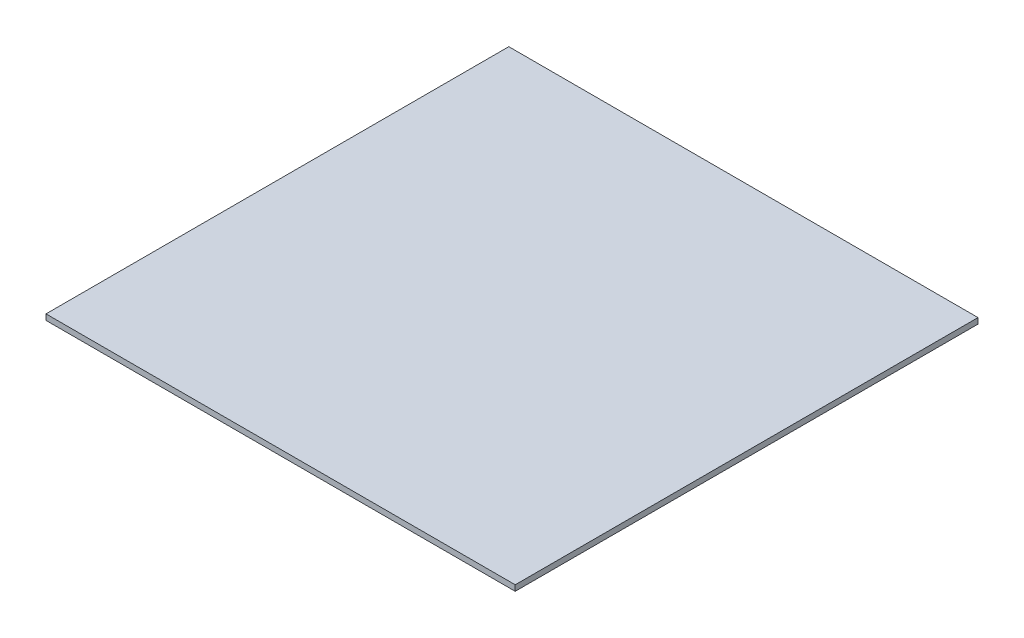
ISO-10303-21;
HEADER;
FILE_DESCRIPTION(('STEP AP214'),'2;1');
FILE_NAME('part.step','',(''),(''),'','','');
FILE_SCHEMA(('AUTOMOTIVE_DESIGN { 1 0 10303 214 1 1 1 1 }'));
ENDSEC;
DATA;
#1=APPLICATION_CONTEXT('core data for automotive mechanical design processes');
#2=APPLICATION_PROTOCOL_DEFINITION('international standard','automotive_design',2000,#1);
#3=PRODUCT_CONTEXT('',#1,'mechanical');
#4=PRODUCT('Part','Part','',(#3));
#5=PRODUCT_RELATED_PRODUCT_CATEGORY('part','',(#4));
#6=PRODUCT_DEFINITION_FORMATION('','',#4);
#7=PRODUCT_DEFINITION_CONTEXT('part definition',#1,'design');
#8=PRODUCT_DEFINITION('design','',#6,#7);
#9=PRODUCT_DEFINITION_SHAPE('','',#8);
#10=(LENGTH_UNIT() NAMED_UNIT(*) SI_UNIT(.MILLI.,.METRE.));
#11=(NAMED_UNIT(*) PLANE_ANGLE_UNIT() SI_UNIT($,.RADIAN.));
#12=(NAMED_UNIT(*) SI_UNIT($,.STERADIAN.) SOLID_ANGLE_UNIT());
#13=UNCERTAINTY_MEASURE_WITH_UNIT(LENGTH_MEASURE(1.E-05),#10,'distance_accuracy_value','');
#14=(GEOMETRIC_REPRESENTATION_CONTEXT(3) GLOBAL_UNCERTAINTY_ASSIGNED_CONTEXT((#13)) GLOBAL_UNIT_ASSIGNED_CONTEXT((#10,
#11,#12)) REPRESENTATION_CONTEXT('',''));
#15=CARTESIAN_POINT('',(0.,0.,0.));
#16=DIRECTION('',(0.,0.,1.));
#17=DIRECTION('',(1.,0.,0.));
#18=AXIS2_PLACEMENT_3D('',#15,#16,#17);
#19=CARTESIAN_POINT('',(492.125,11.938,485.394));
#20=DIRECTION('',(-1.,0.,0.));
#21=DIRECTION('',(0.,0.,1.));
#22=AXIS2_PLACEMENT_3D('',#19,#20,#21);
#23=PLANE('',#22);
#24=DIRECTION('',(0.,0.,-1.));
#25=VECTOR('',#24,1.);
#26=CARTESIAN_POINT('',(492.125,0.,485.394));
#27=LINE('',#26,#25);
#28=CARTESIAN_POINT('',(492.125,0.,485.394));
#29=VERTEX_POINT('',#28);
#30=CARTESIAN_POINT('',(492.125,0.,-485.394));
#31=VERTEX_POINT('',#30);
#32=EDGE_CURVE('E96',#29,#31,#27,.T.);
#33=ORIENTED_EDGE('',*,*,#32,.T.);
#34=DIRECTION('',(0.,-1.,0.));
#35=VECTOR('',#34,1.);
#36=CARTESIAN_POINT('',(492.125,11.938,-485.394));
#37=LINE('',#36,#35);
#38=CARTESIAN_POINT('',(492.125,11.938,-485.394));
#39=VERTEX_POINT('',#38);
#40=EDGE_CURVE('E11',#39,#31,#37,.T.);
#41=ORIENTED_EDGE('',*,*,#40,.F.);
#42=DIRECTION('',(0.,0.,-1.));
#43=VECTOR('',#42,1.);
#44=CARTESIAN_POINT('',(492.125,11.938,485.394));
#45=LINE('',#44,#43);
#46=CARTESIAN_POINT('',(492.125,11.938,485.394));
#47=VERTEX_POINT('',#46);
#48=EDGE_CURVE('E84',#47,#39,#45,.T.);
#49=ORIENTED_EDGE('',*,*,#48,.F.);
#50=DIRECTION('',(0.,-1.,0.));
#51=VECTOR('',#50,1.);
#52=CARTESIAN_POINT('',(492.125,11.938,485.394));
#53=LINE('',#52,#51);
#54=EDGE_CURVE('E92',#47,#29,#53,.T.);
#55=ORIENTED_EDGE('',*,*,#54,.T.);
#56=EDGE_LOOP('',(#33,#41,#49,#55));
#57=FACE_BOUND('',#56,.T.);
#58=ADVANCED_FACE('F33',(#57),#23,.F.);
#59=CARTESIAN_POINT('',(-492.125,11.938,-485.394));
#60=DIRECTION('',(0.,0.,1.));
#61=DIRECTION('',(1.,0.,0.));
#62=AXIS2_PLACEMENT_3D('',#59,#60,#61);
#63=PLANE('',#62);
#64=DIRECTION('',(-1.,0.,0.));
#65=VECTOR('',#64,1.);
#66=CARTESIAN_POINT('',(-492.125,0.,-485.394));
#67=LINE('',#66,#65);
#68=CARTESIAN_POINT('',(-492.125,0.,-485.394));
#69=VERTEX_POINT('',#68);
#70=EDGE_CURVE('E88',#31,#69,#67,.T.);
#71=ORIENTED_EDGE('',*,*,#70,.T.);
#72=DIRECTION('',(0.,-1.,0.));
#73=VECTOR('',#72,1.);
#74=CARTESIAN_POINT('',(-492.125,11.938,-485.394));
#75=LINE('',#74,#73);
#76=CARTESIAN_POINT('',(-492.125,11.938,-485.394));
#77=VERTEX_POINT('',#76);
#78=EDGE_CURVE('E41',#77,#69,#75,.T.);
#79=ORIENTED_EDGE('',*,*,#78,.F.);
#80=DIRECTION('',(-1.,0.,0.));
#81=VECTOR('',#80,1.);
#82=CARTESIAN_POINT('',(-492.125,11.938,-485.394));
#83=LINE('',#82,#81);
#84=EDGE_CURVE('E79',#39,#77,#83,.T.);
#85=ORIENTED_EDGE('',*,*,#84,.F.);
#86=ORIENTED_EDGE('',*,*,#40,.T.);
#87=EDGE_LOOP('',(#71,#79,#85,#86));
#88=FACE_BOUND('',#87,.T.);
#89=ADVANCED_FACE('F87',(#88),#63,.F.);
#90=CARTESIAN_POINT('',(-492.125,11.938,485.394));
#91=DIRECTION('',(1.,0.,0.));
#92=DIRECTION('',(0.,0.,-1.));
#93=AXIS2_PLACEMENT_3D('',#90,#91,#92);
#94=PLANE('',#93);
#95=DIRECTION('',(0.,0.,1.));
#96=VECTOR('',#95,1.);
#97=CARTESIAN_POINT('',(-492.125,0.,485.394));
#98=LINE('',#97,#96);
#99=CARTESIAN_POINT('',(-492.125,0.,485.394));
#100=VERTEX_POINT('',#99);
#101=EDGE_CURVE('E66',#69,#100,#98,.T.);
#102=ORIENTED_EDGE('',*,*,#101,.T.);
#103=DIRECTION('',(0.,-1.,0.));
#104=VECTOR('',#103,1.);
#105=CARTESIAN_POINT('',(-492.125,11.938,485.394));
#106=LINE('',#105,#104);
#107=CARTESIAN_POINT('',(-492.125,11.938,485.394));
#108=VERTEX_POINT('',#107);
#109=EDGE_CURVE('E89',#108,#100,#106,.T.);
#110=ORIENTED_EDGE('',*,*,#109,.F.);
#111=DIRECTION('',(0.,0.,1.));
#112=VECTOR('',#111,1.);
#113=CARTESIAN_POINT('',(-492.125,11.938,485.394));
#114=LINE('',#113,#112);
#115=EDGE_CURVE('E82',#77,#108,#114,.T.);
#116=ORIENTED_EDGE('',*,*,#115,.F.);
#117=ORIENTED_EDGE('',*,*,#78,.T.);
#118=EDGE_LOOP('',(#102,#110,#116,#117));
#119=FACE_BOUND('',#118,.T.);
#120=ADVANCED_FACE('F90',(#119),#94,.F.);
#121=CARTESIAN_POINT('',(-492.125,11.938,485.394));
#122=DIRECTION('',(0.,0.,-1.));
#123=DIRECTION('',(-1.,0.,0.));
#124=AXIS2_PLACEMENT_3D('',#121,#122,#123);
#125=PLANE('',#124);
#126=DIRECTION('',(1.,0.,0.));
#127=VECTOR('',#126,1.);
#128=CARTESIAN_POINT('',(-492.125,0.,485.394));
#129=LINE('',#128,#127);
#130=EDGE_CURVE('E72',#100,#29,#129,.T.);
#131=ORIENTED_EDGE('',*,*,#130,.T.);
#132=ORIENTED_EDGE('',*,*,#54,.F.);
#133=DIRECTION('',(1.,0.,0.));
#134=VECTOR('',#133,1.);
#135=CARTESIAN_POINT('',(-492.125,11.938,485.394));
#136=LINE('',#135,#134);
#137=EDGE_CURVE('E49',#108,#47,#136,.T.);
#138=ORIENTED_EDGE('',*,*,#137,.F.);
#139=ORIENTED_EDGE('',*,*,#109,.T.);
#140=EDGE_LOOP('',(#131,#132,#138,#139));
#141=FACE_BOUND('',#140,.T.);
#142=ADVANCED_FACE('F103',(#141),#125,.F.);
#143=CARTESIAN_POINT('',(0.,11.938,0.));
#144=DIRECTION('',(0.,-1.,0.));
#145=DIRECTION('',(0.,0.,-1.));
#146=AXIS2_PLACEMENT_3D('',#143,#144,#145);
#147=PLANE('',#146);
#148=ORIENTED_EDGE('',*,*,#48,.T.);
#149=ORIENTED_EDGE('',*,*,#84,.T.);
#150=ORIENTED_EDGE('',*,*,#115,.T.);
#151=ORIENTED_EDGE('',*,*,#137,.T.);
#152=EDGE_LOOP('',(#148,#149,#150,#151));
#153=FACE_BOUND('',#152,.T.);
#154=ADVANCED_FACE('F80',(#153),#147,.F.);
#155=CARTESIAN_POINT('',(0.,0.,0.));
#156=DIRECTION('',(0.,-1.,0.));
#157=DIRECTION('',(0.,0.,-1.));
#158=AXIS2_PLACEMENT_3D('',#155,#156,#157);
#159=PLANE('',#158);
#160=ORIENTED_EDGE('',*,*,#32,.F.);
#161=ORIENTED_EDGE('',*,*,#130,.F.);
#162=ORIENTED_EDGE('',*,*,#101,.F.);
#163=ORIENTED_EDGE('',*,*,#70,.F.);
#164=EDGE_LOOP('',(#160,#161,#162,#163));
#165=FACE_BOUND('',#164,.T.);
#166=ADVANCED_FACE('F106',(#165),#159,.T.);
#167=CLOSED_SHELL('',(#58,#89,#120,#142,#154,#166));
#168=MANIFOLD_SOLID_BREP('B2',#167);
#169=ADVANCED_BREP_SHAPE_REPRESENTATION('',(#18,#168),#14);
#170=SHAPE_DEFINITION_REPRESENTATION(#9,#169);
ENDSEC;
END-ISO-10303-21;
